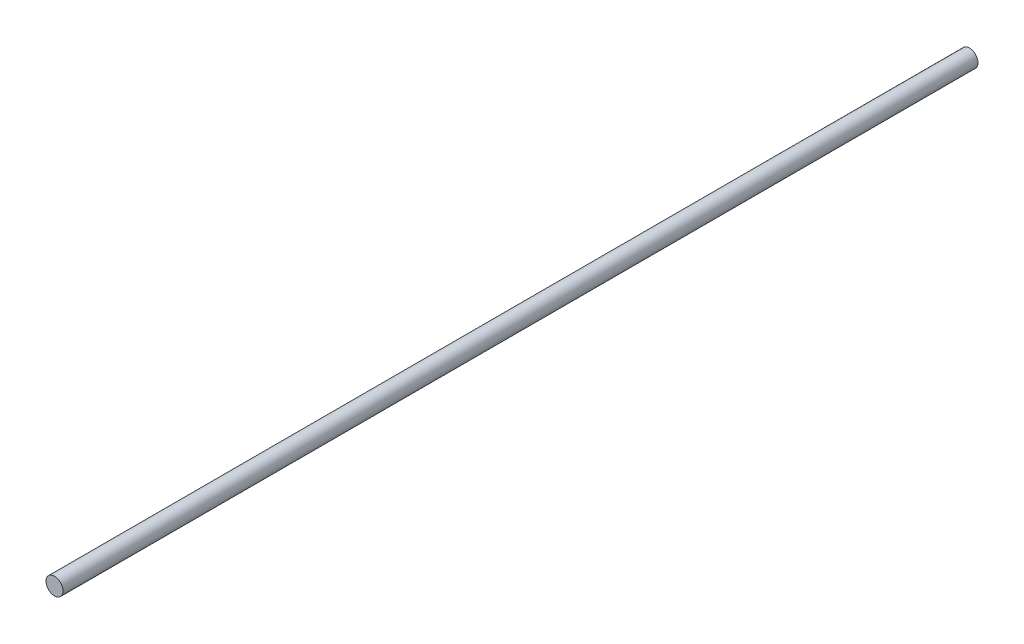
ISO-10303-21;
HEADER;
FILE_DESCRIPTION(('STEP AP214'),'2;1');
FILE_NAME('part.step','',(''),(''),'','','');
FILE_SCHEMA(('AUTOMOTIVE_DESIGN { 1 0 10303 214 1 1 1 1 }'));
ENDSEC;
DATA;
#1=APPLICATION_CONTEXT('core data for automotive mechanical design processes');
#2=APPLICATION_PROTOCOL_DEFINITION('international standard','automotive_design',2000,#1);
#3=PRODUCT_CONTEXT('',#1,'mechanical');
#4=PRODUCT('Part','Part','',(#3));
#5=PRODUCT_RELATED_PRODUCT_CATEGORY('part','',(#4));
#6=PRODUCT_DEFINITION_FORMATION('','',#4);
#7=PRODUCT_DEFINITION_CONTEXT('part definition',#1,'design');
#8=PRODUCT_DEFINITION('design','',#6,#7);
#9=PRODUCT_DEFINITION_SHAPE('','',#8);
#10=(LENGTH_UNIT() NAMED_UNIT(*) SI_UNIT(.MILLI.,.METRE.));
#11=(NAMED_UNIT(*) PLANE_ANGLE_UNIT() SI_UNIT($,.RADIAN.));
#12=(NAMED_UNIT(*) SI_UNIT($,.STERADIAN.) SOLID_ANGLE_UNIT());
#13=UNCERTAINTY_MEASURE_WITH_UNIT(LENGTH_MEASURE(1.E-05),#10,'distance_accuracy_value','');
#14=(GEOMETRIC_REPRESENTATION_CONTEXT(3) GLOBAL_UNCERTAINTY_ASSIGNED_CONTEXT((#13)) GLOBAL_UNIT_ASSIGNED_CONTEXT((#10,
#11,#12)) REPRESENTATION_CONTEXT('',''));
#15=CARTESIAN_POINT('',(0.,0.,0.));
#16=DIRECTION('',(0.,0.,1.));
#17=DIRECTION('',(1.,0.,0.));
#18=AXIS2_PLACEMENT_3D('',#15,#16,#17);
#19=CARTESIAN_POINT('',(0.,0.,428.));
#20=DIRECTION('',(0.,0.,-1.));
#21=DIRECTION('',(-1.,0.,0.));
#22=AXIS2_PLACEMENT_3D('',#19,#20,#21);
#23=CYLINDRICAL_SURFACE('',#22,4.);
#24=CARTESIAN_POINT('',(0.,0.,428.));
#25=DIRECTION('',(0.,0.,1.));
#26=DIRECTION('',(1.,0.,0.));
#27=AXIS2_PLACEMENT_3D('',#24,#25,#26);
#28=CIRCLE('',#27,4.);
#29=CARTESIAN_POINT('',(4.,0.,428.));
#30=VERTEX_POINT('',#29);
#31=EDGE_CURVE('E10',#30,#30,#28,.T.);
#32=ORIENTED_EDGE('',*,*,#31,.F.);
#33=EDGE_LOOP('',(#32));
#34=FACE_BOUND('',#33,.T.);
#35=CARTESIAN_POINT('',(0.,0.,0.));
#36=DIRECTION('',(0.,0.,1.));
#37=DIRECTION('',(1.,0.,0.));
#38=AXIS2_PLACEMENT_3D('',#35,#36,#37);
#39=CIRCLE('',#38,4.);
#40=CARTESIAN_POINT('',(4.,0.,0.));
#41=VERTEX_POINT('',#40);
#42=EDGE_CURVE('E34',#41,#41,#39,.T.);
#43=ORIENTED_EDGE('',*,*,#42,.T.);
#44=EDGE_LOOP('',(#43));
#45=FACE_BOUND('',#44,.T.);
#46=ADVANCED_FACE('F31',(#34,#45),#23,.T.);
#47=CARTESIAN_POINT('',(0.,0.,428.));
#48=DIRECTION('',(0.,0.,1.));
#49=DIRECTION('',(1.,0.,0.));
#50=AXIS2_PLACEMENT_3D('',#47,#48,#49);
#51=PLANE('',#50);
#52=ORIENTED_EDGE('',*,*,#31,.T.);
#53=EDGE_LOOP('',(#52));
#54=FACE_BOUND('',#53,.T.);
#55=ADVANCED_FACE('F46',(#54),#51,.T.);
#56=CARTESIAN_POINT('',(0.,0.,0.));
#57=DIRECTION('',(0.,0.,1.));
#58=DIRECTION('',(1.,0.,0.));
#59=AXIS2_PLACEMENT_3D('',#56,#57,#58);
#60=PLANE('',#59);
#61=ORIENTED_EDGE('',*,*,#42,.F.);
#62=EDGE_LOOP('',(#61));
#63=FACE_BOUND('',#62,.T.);
#64=ADVANCED_FACE('F44',(#63),#60,.F.);
#65=CLOSED_SHELL('',(#46,#55,#64));
#66=MANIFOLD_SOLID_BREP('B2',#65);
#67=ADVANCED_BREP_SHAPE_REPRESENTATION('',(#18,#66),#14);
#68=SHAPE_DEFINITION_REPRESENTATION(#9,#67);
ENDSEC;
END-ISO-10303-21;
